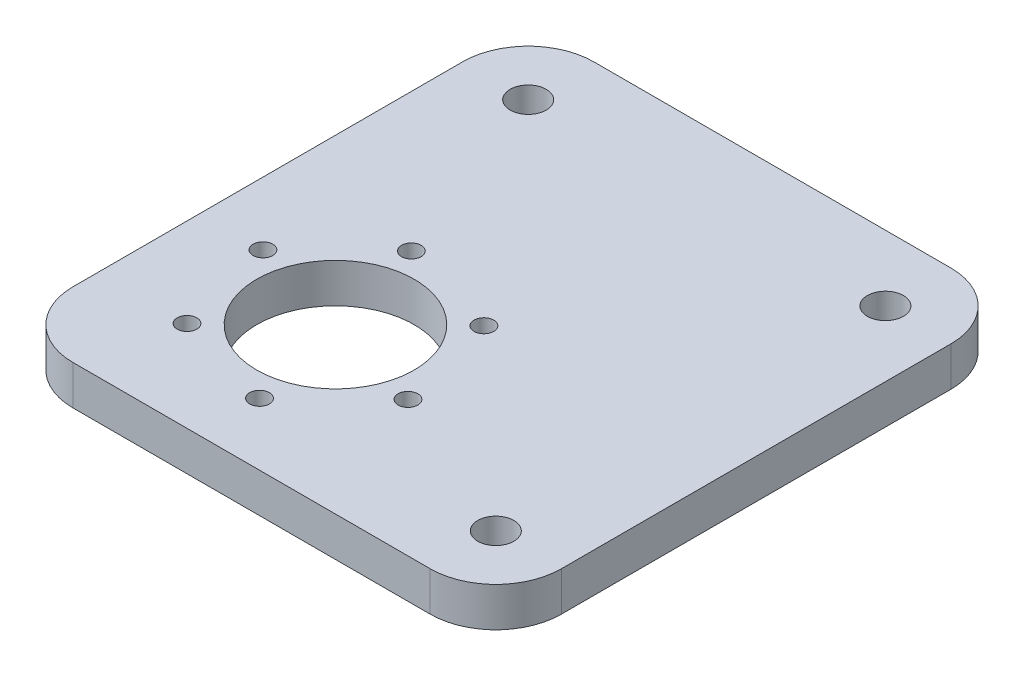
ISO-10303-21;
HEADER;
FILE_DESCRIPTION(('STEP AP214'),'2;1');
FILE_NAME('part.step','',(''),(''),'','','');
FILE_SCHEMA(('AUTOMOTIVE_DESIGN { 1 0 10303 214 1 1 1 1 }'));
ENDSEC;
DATA;
#1=APPLICATION_CONTEXT('core data for automotive mechanical design processes');
#2=APPLICATION_PROTOCOL_DEFINITION('international standard','automotive_design',2000,#1);
#3=PRODUCT_CONTEXT('',#1,'mechanical');
#4=PRODUCT('Part','Part','',(#3));
#5=PRODUCT_RELATED_PRODUCT_CATEGORY('part','',(#4));
#6=PRODUCT_DEFINITION_FORMATION('','',#4);
#7=PRODUCT_DEFINITION_CONTEXT('part definition',#1,'design');
#8=PRODUCT_DEFINITION('design','',#6,#7);
#9=PRODUCT_DEFINITION_SHAPE('','',#8);
#10=(LENGTH_UNIT() NAMED_UNIT(*) SI_UNIT(.MILLI.,.METRE.));
#11=(NAMED_UNIT(*) PLANE_ANGLE_UNIT() SI_UNIT($,.RADIAN.));
#12=(NAMED_UNIT(*) SI_UNIT($,.STERADIAN.) SOLID_ANGLE_UNIT());
#13=UNCERTAINTY_MEASURE_WITH_UNIT(LENGTH_MEASURE(1.E-05),#10,'distance_accuracy_value','');
#14=(GEOMETRIC_REPRESENTATION_CONTEXT(3) GLOBAL_UNCERTAINTY_ASSIGNED_CONTEXT((#13)) GLOBAL_UNIT_ASSIGNED_CONTEXT((#10,
#11,#12)) REPRESENTATION_CONTEXT('',''));
#15=CARTESIAN_POINT('',(0.,0.,0.));
#16=DIRECTION('',(0.,0.,1.));
#17=DIRECTION('',(1.,0.,0.));
#18=AXIS2_PLACEMENT_3D('',#15,#16,#17);
#19=CARTESIAN_POINT('',(0.,6.,0.));
#20=DIRECTION('',(0.,1.,0.));
#21=DIRECTION('',(0.,0.,1.));
#22=AXIS2_PLACEMENT_3D('',#19,#20,#21);
#23=PLANE('',#22);
#24=CARTESIAN_POINT('',(21.7056647036623,6.,5.19863708426601));
#25=DIRECTION('',(0.,-1.,0.));
#26=DIRECTION('',(0.,0.,-1.));
#27=AXIS2_PLACEMENT_3D('',#24,#25,#26);
#28=CIRCLE('',#27,1.5);
#29=CARTESIAN_POINT('',(21.7056647036623,6.,3.69863708426601));
#30=VERTEX_POINT('',#29);
#31=EDGE_CURVE('E199',#30,#30,#28,.T.);
#32=ORIENTED_EDGE('',*,*,#31,.T.);
#33=EDGE_LOOP('',(#32));
#34=FACE_BOUND('',#33,.T.);
#35=CARTESIAN_POINT('',(17.7684552129794,6.,-10.3093731500122));
#36=DIRECTION('',(0.,-1.,0.));
#37=DIRECTION('',(0.,0.,-1.));
#38=AXIS2_PLACEMENT_3D('',#35,#36,#37);
#39=CIRCLE('',#38,1.5);
#40=CARTESIAN_POINT('',(17.7684552129794,6.,-11.8093731500122));
#41=VERTEX_POINT('',#40);
#42=EDGE_CURVE('E228',#41,#41,#39,.T.);
#43=ORIENTED_EDGE('',*,*,#42,.T.);
#44=EDGE_LOOP('',(#43));
#45=FACE_BOUND('',#44,.T.);
#46=CARTESIAN_POINT('',(2.36951964260416,6.,-14.6536548281987));
#47=DIRECTION('',(0.,-1.,0.));
#48=DIRECTION('',(0.,0.,-1.));
#49=AXIS2_PLACEMENT_3D('',#46,#47,#48);
#50=CIRCLE('',#49,1.5);
#51=CARTESIAN_POINT('',(2.36951964260416,6.,-16.1536548281987));
#52=VERTEX_POINT('',#51);
#53=EDGE_CURVE('E216',#52,#52,#50,.T.);
#54=ORIENTED_EDGE('',*,*,#53,.T.);
#55=EDGE_LOOP('',(#54));
#56=FACE_BOUND('',#55,.T.);
#57=CARTESIAN_POINT('',(-9.0922064370885,6.,-3.48992627210719));
#58=DIRECTION('',(0.,-1.,0.));
#59=DIRECTION('',(0.,0.,-1.));
#60=AXIS2_PLACEMENT_3D('',#57,#58,#59);
#61=CIRCLE('',#60,1.5);
#62=CARTESIAN_POINT('',(-9.0922064370885,6.,-4.98992627210719));
#63=VERTEX_POINT('',#62);
#64=EDGE_CURVE('E213',#63,#63,#61,.T.);
#65=ORIENTED_EDGE('',*,*,#64,.T.);
#66=EDGE_LOOP('',(#65));
#67=FACE_BOUND('',#66,.T.);
#68=CARTESIAN_POINT('',(-5.15499694640573,6.,12.018083962171));
#69=DIRECTION('',(0.,-1.,0.));
#70=DIRECTION('',(0.,0.,-1.));
#71=AXIS2_PLACEMENT_3D('',#68,#69,#70);
#72=CIRCLE('',#71,1.5);
#73=CARTESIAN_POINT('',(-5.15499694640573,6.,10.518083962171));
#74=VERTEX_POINT('',#73);
#75=EDGE_CURVE('E206',#74,#74,#72,.T.);
#76=ORIENTED_EDGE('',*,*,#75,.T.);
#77=EDGE_LOOP('',(#76));
#78=FACE_BOUND('',#77,.T.);
#79=CARTESIAN_POINT('',(10.2439386239696,6.,16.3623656403577));
#80=DIRECTION('',(0.,-1.,0.));
#81=DIRECTION('',(0.,0.,-1.));
#82=AXIS2_PLACEMENT_3D('',#79,#80,#81);
#83=CIRCLE('',#82,1.5);
#84=CARTESIAN_POINT('',(10.2439386239696,6.,14.8623656403577));
#85=VERTEX_POINT('',#84);
#86=EDGE_CURVE('E205',#85,#85,#83,.T.);
#87=ORIENTED_EDGE('',*,*,#86,.T.);
#88=EDGE_LOOP('',(#87));
#89=FACE_BOUND('',#88,.T.);
#90=CARTESIAN_POINT('',(45.7467291332951,6.,15.8543554061125));
#91=DIRECTION('',(0.,1.,0.));
#92=DIRECTION('',(0.,0.,1.));
#93=AXIS2_PLACEMENT_3D('',#90,#91,#92);
#94=CIRCLE('',#93,2.75);
#95=CARTESIAN_POINT('',(45.7467291332951,6.,18.6043554061125));
#96=VERTEX_POINT('',#95);
#97=EDGE_CURVE('E185',#96,#96,#94,.T.);
#98=ORIENTED_EDGE('',*,*,#97,.F.);
#99=EDGE_LOOP('',(#98));
#100=FACE_BOUND('',#99,.T.);
#101=CARTESIAN_POINT('',(45.7467291332951,6.,-43.5256445938875));
#102=DIRECTION('',(0.,1.,0.));
#103=DIRECTION('',(0.,0.,1.));
#104=AXIS2_PLACEMENT_3D('',#101,#102,#103);
#105=CIRCLE('',#104,2.75);
#106=CARTESIAN_POINT('',(45.7467291332951,6.,-40.7756445938875));
#107=VERTEX_POINT('',#106);
#108=EDGE_CURVE('E187',#107,#107,#105,.T.);
#109=ORIENTED_EDGE('',*,*,#108,.F.);
#110=EDGE_LOOP('',(#109));
#111=FACE_BOUND('',#110,.T.);
#112=CARTESIAN_POINT('',(-8.69327086670492,6.,-43.5256445938875));
#113=DIRECTION('',(0.,1.,0.));
#114=DIRECTION('',(0.,0.,1.));
#115=AXIS2_PLACEMENT_3D('',#112,#113,#114);
#116=CIRCLE('',#115,2.75);
#117=CARTESIAN_POINT('',(-8.69327086670492,6.,-40.7756445938875));
#118=VERTEX_POINT('',#117);
#119=EDGE_CURVE('E186',#118,#118,#116,.T.);
#120=ORIENTED_EDGE('',*,*,#119,.F.);
#121=EDGE_LOOP('',(#120));
#122=FACE_BOUND('',#121,.T.);
#123=DIRECTION('',(0.,0.,-1.));
#124=VECTOR('',#123,1.);
#125=CARTESIAN_POINT('',(55.7467291332951,6.,-53.5256445938875));
#126=LINE('',#125,#124);
#127=CARTESIAN_POINT('',(55.7467291332951,6.,15.8543554061125));
#128=VERTEX_POINT('',#127);
#129=CARTESIAN_POINT('',(55.7467291332951,6.,-43.5256445938875));
#130=VERTEX_POINT('',#129);
#131=EDGE_CURVE('E180',#128,#130,#126,.T.);
#132=ORIENTED_EDGE('',*,*,#131,.T.);
#133=CARTESIAN_POINT('',(45.7467291332951,6.,-43.5256445938875));
#134=DIRECTION('',(0.,1.,0.));
#135=DIRECTION('',(0.,0.,1.));
#136=AXIS2_PLACEMENT_3D('',#133,#134,#135);
#137=CIRCLE('',#136,10.);
#138=CARTESIAN_POINT('',(45.7467291332951,6.,-53.5256445938875));
#139=VERTEX_POINT('',#138);
#140=EDGE_CURVE('E155',#130,#139,#137,.T.);
#141=ORIENTED_EDGE('',*,*,#140,.T.);
#142=DIRECTION('',(-1.,0.,0.));
#143=VECTOR('',#142,1.);
#144=CARTESIAN_POINT('',(-18.6932708667049,6.,-53.5256445938875));
#145=LINE('',#144,#143);
#146=CARTESIAN_POINT('',(-8.69327086670492,6.,-53.5256445938875));
#147=VERTEX_POINT('',#146);
#148=EDGE_CURVE('E123',#139,#147,#145,.T.);
#149=ORIENTED_EDGE('',*,*,#148,.T.);
#150=CARTESIAN_POINT('',(-8.69327086670492,6.,-43.5256445938875));
#151=DIRECTION('',(0.,1.,0.));
#152=DIRECTION('',(0.,0.,1.));
#153=AXIS2_PLACEMENT_3D('',#150,#151,#152);
#154=CIRCLE('',#153,10.);
#155=CARTESIAN_POINT('',(-18.6932708667049,6.,-43.5256445938875));
#156=VERTEX_POINT('',#155);
#157=EDGE_CURVE('E154',#147,#156,#154,.T.);
#158=ORIENTED_EDGE('',*,*,#157,.T.);
#159=DIRECTION('',(0.,0.,1.));
#160=VECTOR('',#159,1.);
#161=CARTESIAN_POINT('',(-18.6932708667049,6.,-53.5256445938875));
#162=LINE('',#161,#160);
#163=CARTESIAN_POINT('',(-18.6932708667049,6.,15.8543554061125));
#164=VERTEX_POINT('',#163);
#165=EDGE_CURVE('E134',#156,#164,#162,.T.);
#166=ORIENTED_EDGE('',*,*,#165,.T.);
#167=CARTESIAN_POINT('',(-8.69327086670492,6.,15.8543554061125));
#168=DIRECTION('',(0.,1.,0.));
#169=DIRECTION('',(0.,0.,1.));
#170=AXIS2_PLACEMENT_3D('',#167,#168,#169);
#171=CIRCLE('',#170,10.);
#172=CARTESIAN_POINT('',(-8.69327086670492,6.,25.8543554061125));
#173=VERTEX_POINT('',#172);
#174=EDGE_CURVE('E58',#164,#173,#171,.T.);
#175=ORIENTED_EDGE('',*,*,#174,.T.);
#176=DIRECTION('',(1.,0.,0.));
#177=VECTOR('',#176,1.);
#178=CARTESIAN_POINT('',(-18.6932708667049,6.,25.8543554061125));
#179=LINE('',#178,#177);
#180=CARTESIAN_POINT('',(45.7467291332951,6.,25.8543554061125));
#181=VERTEX_POINT('',#180);
#182=EDGE_CURVE('E131',#173,#181,#179,.T.);
#183=ORIENTED_EDGE('',*,*,#182,.T.);
#184=CARTESIAN_POINT('',(45.7467291332951,6.,15.8543554061125));
#185=DIRECTION('',(0.,1.,0.));
#186=DIRECTION('',(0.,0.,1.));
#187=AXIS2_PLACEMENT_3D('',#184,#185,#186);
#188=CIRCLE('',#187,10.);
#189=EDGE_CURVE('E148',#181,#128,#188,.T.);
#190=ORIENTED_EDGE('',*,*,#189,.T.);
#191=EDGE_LOOP('',(#132,#141,#149,#158,#166,#175,#183,#190));
#192=FACE_BOUND('',#191,.T.);
#193=CARTESIAN_POINT('',(6.30672913329509,6.,0.854355406112513));
#194=DIRECTION('',(0.,1.,0.));
#195=DIRECTION('',(0.,0.,1.));
#196=AXIS2_PLACEMENT_3D('',#193,#194,#195);
#197=CIRCLE('',#196,12.);
#198=CARTESIAN_POINT('',(6.30672913329509,6.,12.8543554061125));
#199=VERTEX_POINT('',#198);
#200=EDGE_CURVE('E167',#199,#199,#197,.T.);
#201=ORIENTED_EDGE('',*,*,#200,.F.);
#202=EDGE_LOOP('',(#201));
#203=FACE_BOUND('',#202,.T.);
#204=ADVANCED_FACE('F39',(#34,#45,#56,#67,#78,#89,#100,#111,#122,#192,#203),#23,.T.);
#205=CARTESIAN_POINT('',(0.,0.,0.));
#206=DIRECTION('',(0.,1.,0.));
#207=DIRECTION('',(0.,0.,1.));
#208=AXIS2_PLACEMENT_3D('',#205,#206,#207);
#209=PLANE('',#208);
#210=CARTESIAN_POINT('',(21.7056647036623,0.,5.19863708426601));
#211=DIRECTION('',(0.,-1.,0.));
#212=DIRECTION('',(0.,0.,-1.));
#213=AXIS2_PLACEMENT_3D('',#210,#211,#212);
#214=CIRCLE('',#213,1.5);
#215=CARTESIAN_POINT('',(21.7056647036623,0.,3.69863708426601));
#216=VERTEX_POINT('',#215);
#217=EDGE_CURVE('E235',#216,#216,#214,.T.);
#218=ORIENTED_EDGE('',*,*,#217,.F.);
#219=EDGE_LOOP('',(#218));
#220=FACE_BOUND('',#219,.T.);
#221=CARTESIAN_POINT('',(17.7684552129794,0.,-10.3093731500122));
#222=DIRECTION('',(0.,-1.,0.));
#223=DIRECTION('',(0.,0.,-1.));
#224=AXIS2_PLACEMENT_3D('',#221,#222,#223);
#225=CIRCLE('',#224,1.5);
#226=CARTESIAN_POINT('',(17.7684552129794,0.,-11.8093731500122));
#227=VERTEX_POINT('',#226);
#228=EDGE_CURVE('E230',#227,#227,#225,.T.);
#229=ORIENTED_EDGE('',*,*,#228,.F.);
#230=EDGE_LOOP('',(#229));
#231=FACE_BOUND('',#230,.T.);
#232=CARTESIAN_POINT('',(2.36951964260416,0.,-14.6536548281987));
#233=DIRECTION('',(0.,-1.,0.));
#234=DIRECTION('',(0.,0.,-1.));
#235=AXIS2_PLACEMENT_3D('',#232,#233,#234);
#236=CIRCLE('',#235,1.5);
#237=CARTESIAN_POINT('',(2.36951964260416,0.,-16.1536548281987));
#238=VERTEX_POINT('',#237);
#239=EDGE_CURVE('E221',#238,#238,#236,.T.);
#240=ORIENTED_EDGE('',*,*,#239,.F.);
#241=EDGE_LOOP('',(#240));
#242=FACE_BOUND('',#241,.T.);
#243=CARTESIAN_POINT('',(-9.0922064370885,0.,-3.48992627210719));
#244=DIRECTION('',(0.,-1.,0.));
#245=DIRECTION('',(0.,0.,-1.));
#246=AXIS2_PLACEMENT_3D('',#243,#244,#245);
#247=CIRCLE('',#246,1.5);
#248=CARTESIAN_POINT('',(-9.0922064370885,0.,-4.98992627210719));
#249=VERTEX_POINT('',#248);
#250=EDGE_CURVE('E219',#249,#249,#247,.T.);
#251=ORIENTED_EDGE('',*,*,#250,.F.);
#252=EDGE_LOOP('',(#251));
#253=FACE_BOUND('',#252,.T.);
#254=CARTESIAN_POINT('',(-5.15499694640573,0.,12.018083962171));
#255=DIRECTION('',(0.,-1.,0.));
#256=DIRECTION('',(0.,0.,-1.));
#257=AXIS2_PLACEMENT_3D('',#254,#255,#256);
#258=CIRCLE('',#257,1.5);
#259=CARTESIAN_POINT('',(-5.15499694640573,0.,10.518083962171));
#260=VERTEX_POINT('',#259);
#261=EDGE_CURVE('E211',#260,#260,#258,.T.);
#262=ORIENTED_EDGE('',*,*,#261,.F.);
#263=EDGE_LOOP('',(#262));
#264=FACE_BOUND('',#263,.T.);
#265=CARTESIAN_POINT('',(10.2439386239696,0.,16.3623656403577));
#266=DIRECTION('',(0.,-1.,0.));
#267=DIRECTION('',(0.,0.,-1.));
#268=AXIS2_PLACEMENT_3D('',#265,#266,#267);
#269=CIRCLE('',#268,1.5);
#270=CARTESIAN_POINT('',(10.2439386239696,0.,14.8623656403577));
#271=VERTEX_POINT('',#270);
#272=EDGE_CURVE('E204',#271,#271,#269,.T.);
#273=ORIENTED_EDGE('',*,*,#272,.F.);
#274=EDGE_LOOP('',(#273));
#275=FACE_BOUND('',#274,.T.);
#276=CARTESIAN_POINT('',(45.7467291332951,0.,15.8543554061125));
#277=DIRECTION('',(0.,-1.,0.));
#278=DIRECTION('',(0.,0.,-1.));
#279=AXIS2_PLACEMENT_3D('',#276,#277,#278);
#280=CIRCLE('',#279,2.75);
#281=CARTESIAN_POINT('',(45.7467291332951,0.,13.1043554061125));
#282=VERTEX_POINT('',#281);
#283=EDGE_CURVE('E195',#282,#282,#280,.T.);
#284=ORIENTED_EDGE('',*,*,#283,.F.);
#285=EDGE_LOOP('',(#284));
#286=FACE_BOUND('',#285,.T.);
#287=CARTESIAN_POINT('',(45.7467291332951,0.,-43.5256445938875));
#288=DIRECTION('',(0.,-1.,0.));
#289=DIRECTION('',(0.,0.,-1.));
#290=AXIS2_PLACEMENT_3D('',#287,#288,#289);
#291=CIRCLE('',#290,2.75);
#292=CARTESIAN_POINT('',(45.7467291332951,0.,-46.2756445938875));
#293=VERTEX_POINT('',#292);
#294=EDGE_CURVE('E198',#293,#293,#291,.T.);
#295=ORIENTED_EDGE('',*,*,#294,.F.);
#296=EDGE_LOOP('',(#295));
#297=FACE_BOUND('',#296,.T.);
#298=CARTESIAN_POINT('',(-8.69327086670492,0.,-43.5256445938875));
#299=DIRECTION('',(0.,-1.,0.));
#300=DIRECTION('',(0.,0.,-1.));
#301=AXIS2_PLACEMENT_3D('',#298,#299,#300);
#302=CIRCLE('',#301,2.75);
#303=CARTESIAN_POINT('',(-8.69327086670492,0.,-46.2756445938875));
#304=VERTEX_POINT('',#303);
#305=EDGE_CURVE('E192',#304,#304,#302,.T.);
#306=ORIENTED_EDGE('',*,*,#305,.F.);
#307=EDGE_LOOP('',(#306));
#308=FACE_BOUND('',#307,.T.);
#309=DIRECTION('',(-1.,0.,0.));
#310=VECTOR('',#309,1.);
#311=CARTESIAN_POINT('',(-18.6932708667049,0.,-53.5256445938875));
#312=LINE('',#311,#310);
#313=CARTESIAN_POINT('',(45.7467291332951,0.,-53.5256445938875));
#314=VERTEX_POINT('',#313);
#315=CARTESIAN_POINT('',(-8.69327086670492,0.,-53.5256445938875));
#316=VERTEX_POINT('',#315);
#317=EDGE_CURVE('E125',#314,#316,#312,.T.);
#318=ORIENTED_EDGE('',*,*,#317,.F.);
#319=CARTESIAN_POINT('',(45.7467291332951,0.,-43.5256445938875));
#320=DIRECTION('',(0.,1.,0.));
#321=DIRECTION('',(0.,0.,1.));
#322=AXIS2_PLACEMENT_3D('',#319,#320,#321);
#323=CIRCLE('',#322,10.);
#324=CARTESIAN_POINT('',(55.7467291332951,0.,-43.5256445938875));
#325=VERTEX_POINT('',#324);
#326=EDGE_CURVE('E102',#314,#325,#323,.F.);
#327=ORIENTED_EDGE('',*,*,#326,.T.);
#328=DIRECTION('',(0.,0.,-1.));
#329=VECTOR('',#328,1.);
#330=CARTESIAN_POINT('',(55.7467291332951,0.,-53.5256445938875));
#331=LINE('',#330,#329);
#332=CARTESIAN_POINT('',(55.7467291332951,0.,15.8543554061125));
#333=VERTEX_POINT('',#332);
#334=EDGE_CURVE('E132',#333,#325,#331,.T.);
#335=ORIENTED_EDGE('',*,*,#334,.F.);
#336=CARTESIAN_POINT('',(45.7467291332951,0.,15.8543554061125));
#337=DIRECTION('',(0.,1.,0.));
#338=DIRECTION('',(0.,0.,1.));
#339=AXIS2_PLACEMENT_3D('',#336,#337,#338);
#340=CIRCLE('',#339,10.);
#341=CARTESIAN_POINT('',(45.7467291332951,0.,25.8543554061125));
#342=VERTEX_POINT('',#341);
#343=EDGE_CURVE('E126',#333,#342,#340,.F.);
#344=ORIENTED_EDGE('',*,*,#343,.T.);
#345=DIRECTION('',(1.,0.,0.));
#346=VECTOR('',#345,1.);
#347=CARTESIAN_POINT('',(-18.6932708667049,0.,25.8543554061125));
#348=LINE('',#347,#346);
#349=CARTESIAN_POINT('',(-8.69327086670492,0.,25.8543554061125));
#350=VERTEX_POINT('',#349);
#351=EDGE_CURVE('E140',#350,#342,#348,.T.);
#352=ORIENTED_EDGE('',*,*,#351,.F.);
#353=CARTESIAN_POINT('',(-8.69327086670492,0.,15.8543554061125));
#354=DIRECTION('',(0.,1.,0.));
#355=DIRECTION('',(0.,0.,1.));
#356=AXIS2_PLACEMENT_3D('',#353,#354,#355);
#357=CIRCLE('',#356,10.);
#358=CARTESIAN_POINT('',(-18.6932708667049,0.,15.8543554061125));
#359=VERTEX_POINT('',#358);
#360=EDGE_CURVE('E141',#350,#359,#357,.F.);
#361=ORIENTED_EDGE('',*,*,#360,.T.);
#362=DIRECTION('',(0.,0.,1.));
#363=VECTOR('',#362,1.);
#364=CARTESIAN_POINT('',(-18.6932708667049,0.,-53.5256445938875));
#365=LINE('',#364,#363);
#366=CARTESIAN_POINT('',(-18.6932708667049,0.,-43.5256445938875));
#367=VERTEX_POINT('',#366);
#368=EDGE_CURVE('E164',#367,#359,#365,.T.);
#369=ORIENTED_EDGE('',*,*,#368,.F.);
#370=CARTESIAN_POINT('',(-8.69327086670492,0.,-43.5256445938875));
#371=DIRECTION('',(0.,1.,0.));
#372=DIRECTION('',(0.,0.,1.));
#373=AXIS2_PLACEMENT_3D('',#370,#371,#372);
#374=CIRCLE('',#373,10.);
#375=EDGE_CURVE('E116',#367,#316,#374,.F.);
#376=ORIENTED_EDGE('',*,*,#375,.T.);
#377=EDGE_LOOP('',(#318,#327,#335,#344,#352,#361,#369,#376));
#378=FACE_BOUND('',#377,.T.);
#379=CARTESIAN_POINT('',(6.30672913329509,0.,0.854355406112513));
#380=DIRECTION('',(0.,1.,0.));
#381=DIRECTION('',(0.,0.,1.));
#382=AXIS2_PLACEMENT_3D('',#379,#380,#381);
#383=CIRCLE('',#382,12.);
#384=CARTESIAN_POINT('',(6.30672913329509,0.,12.8543554061125));
#385=VERTEX_POINT('',#384);
#386=EDGE_CURVE('E173',#385,#385,#383,.T.);
#387=ORIENTED_EDGE('',*,*,#386,.T.);
#388=EDGE_LOOP('',(#387));
#389=FACE_BOUND('',#388,.T.);
#390=ADVANCED_FACE('F128',(#220,#231,#242,#253,#264,#275,#286,#297,#308,#378,#389),#209,.F.);
#391=CARTESIAN_POINT('',(-18.6932708667049,6.,-53.5256445938875));
#392=DIRECTION('',(1.,0.,0.));
#393=DIRECTION('',(0.,0.,-1.));
#394=AXIS2_PLACEMENT_3D('',#391,#392,#393);
#395=PLANE('',#394);
#396=ORIENTED_EDGE('',*,*,#165,.F.);
#397=DIRECTION('',(0.,-1.,0.));
#398=VECTOR('',#397,1.);
#399=CARTESIAN_POINT('',(-18.6932708667049,6.,-43.5256445938875));
#400=LINE('',#399,#398);
#401=EDGE_CURVE('E156',#156,#367,#400,.T.);
#402=ORIENTED_EDGE('',*,*,#401,.T.);
#403=ORIENTED_EDGE('',*,*,#368,.T.);
#404=DIRECTION('',(0.,-1.,0.));
#405=VECTOR('',#404,1.);
#406=CARTESIAN_POINT('',(-18.6932708667049,6.,15.8543554061125));
#407=LINE('',#406,#405);
#408=EDGE_CURVE('E158',#359,#164,#407,.F.);
#409=ORIENTED_EDGE('',*,*,#408,.T.);
#410=EDGE_LOOP('',(#396,#402,#403,#409));
#411=FACE_BOUND('',#410,.T.);
#412=ADVANCED_FACE('F165',(#411),#395,.F.);
#413=CARTESIAN_POINT('',(-18.6932708667049,6.,25.8543554061125));
#414=DIRECTION('',(0.,0.,-1.));
#415=DIRECTION('',(-1.,0.,0.));
#416=AXIS2_PLACEMENT_3D('',#413,#414,#415);
#417=PLANE('',#416);
#418=ORIENTED_EDGE('',*,*,#182,.F.);
#419=DIRECTION('',(0.,-1.,0.));
#420=VECTOR('',#419,1.);
#421=CARTESIAN_POINT('',(-8.69327086670492,6.,25.8543554061125));
#422=LINE('',#421,#420);
#423=EDGE_CURVE('E11',#173,#350,#422,.T.);
#424=ORIENTED_EDGE('',*,*,#423,.T.);
#425=ORIENTED_EDGE('',*,*,#351,.T.);
#426=DIRECTION('',(0.,-1.,0.));
#427=VECTOR('',#426,1.);
#428=CARTESIAN_POINT('',(45.7467291332951,6.,25.8543554061125));
#429=LINE('',#428,#427);
#430=EDGE_CURVE('E50',#342,#181,#429,.F.);
#431=ORIENTED_EDGE('',*,*,#430,.T.);
#432=EDGE_LOOP('',(#418,#424,#425,#431));
#433=FACE_BOUND('',#432,.T.);
#434=ADVANCED_FACE('F293',(#433),#417,.F.);
#435=CARTESIAN_POINT('',(55.7467291332951,6.,-53.5256445938875));
#436=DIRECTION('',(-1.,0.,0.));
#437=DIRECTION('',(0.,0.,1.));
#438=AXIS2_PLACEMENT_3D('',#435,#436,#437);
#439=PLANE('',#438);
#440=ORIENTED_EDGE('',*,*,#334,.T.);
#441=DIRECTION('',(0.,-1.,0.));
#442=VECTOR('',#441,1.);
#443=CARTESIAN_POINT('',(55.7467291332951,6.,-43.5256445938875));
#444=LINE('',#443,#442);
#445=EDGE_CURVE('E109',#325,#130,#444,.F.);
#446=ORIENTED_EDGE('',*,*,#445,.T.);
#447=ORIENTED_EDGE('',*,*,#131,.F.);
#448=DIRECTION('',(0.,-1.,0.));
#449=VECTOR('',#448,1.);
#450=CARTESIAN_POINT('',(55.7467291332951,6.,15.8543554061125));
#451=LINE('',#450,#449);
#452=EDGE_CURVE('E114',#128,#333,#451,.T.);
#453=ORIENTED_EDGE('',*,*,#452,.T.);
#454=EDGE_LOOP('',(#440,#446,#447,#453));
#455=FACE_BOUND('',#454,.T.);
#456=ADVANCED_FACE('F286',(#455),#439,.F.);
#457=CARTESIAN_POINT('',(-18.6932708667049,6.,-53.5256445938875));
#458=DIRECTION('',(0.,0.,1.));
#459=DIRECTION('',(1.,0.,0.));
#460=AXIS2_PLACEMENT_3D('',#457,#458,#459);
#461=PLANE('',#460);
#462=ORIENTED_EDGE('',*,*,#148,.F.);
#463=DIRECTION('',(0.,-1.,0.));
#464=VECTOR('',#463,1.);
#465=CARTESIAN_POINT('',(45.7467291332951,6.,-53.5256445938875));
#466=LINE('',#465,#464);
#467=EDGE_CURVE('E107',#139,#314,#466,.T.);
#468=ORIENTED_EDGE('',*,*,#467,.T.);
#469=ORIENTED_EDGE('',*,*,#317,.T.);
#470=DIRECTION('',(0.,-1.,0.));
#471=VECTOR('',#470,1.);
#472=CARTESIAN_POINT('',(-8.69327086670492,6.,-53.5256445938875));
#473=LINE('',#472,#471);
#474=EDGE_CURVE('E130',#316,#147,#473,.F.);
#475=ORIENTED_EDGE('',*,*,#474,.T.);
#476=EDGE_LOOP('',(#462,#468,#469,#475));
#477=FACE_BOUND('',#476,.T.);
#478=ADVANCED_FACE('F122',(#477),#461,.F.);
#479=CARTESIAN_POINT('',(6.30672913329509,6.,0.854355406112513));
#480=DIRECTION('',(0.,-1.,0.));
#481=DIRECTION('',(0.,0.,-1.));
#482=AXIS2_PLACEMENT_3D('',#479,#480,#481);
#483=CYLINDRICAL_SURFACE('',#482,12.);
#484=ORIENTED_EDGE('',*,*,#200,.T.);
#485=EDGE_LOOP('',(#484));
#486=FACE_BOUND('',#485,.T.);
#487=ORIENTED_EDGE('',*,*,#386,.F.);
#488=EDGE_LOOP('',(#487));
#489=FACE_BOUND('',#488,.T.);
#490=ADVANCED_FACE('F267',(#486,#489),#483,.F.);
#491=CARTESIAN_POINT('',(-8.69327086670492,10.,-43.5256445938875));
#492=DIRECTION('',(0.,-1.,0.));
#493=DIRECTION('',(0.,0.,-1.));
#494=AXIS2_PLACEMENT_3D('',#491,#492,#493);
#495=CYLINDRICAL_SURFACE('',#494,2.75);
#496=ORIENTED_EDGE('',*,*,#119,.T.);
#497=EDGE_LOOP('',(#496));
#498=FACE_BOUND('',#497,.T.);
#499=ORIENTED_EDGE('',*,*,#305,.T.);
#500=EDGE_LOOP('',(#499));
#501=FACE_BOUND('',#500,.T.);
#502=ADVANCED_FACE('F268',(#498,#501),#495,.F.);
#503=CARTESIAN_POINT('',(45.7467291332951,10.,-43.5256445938875));
#504=DIRECTION('',(0.,-1.,0.));
#505=DIRECTION('',(0.,0.,-1.));
#506=AXIS2_PLACEMENT_3D('',#503,#504,#505);
#507=CYLINDRICAL_SURFACE('',#506,2.75);
#508=ORIENTED_EDGE('',*,*,#108,.T.);
#509=EDGE_LOOP('',(#508));
#510=FACE_BOUND('',#509,.T.);
#511=ORIENTED_EDGE('',*,*,#294,.T.);
#512=EDGE_LOOP('',(#511));
#513=FACE_BOUND('',#512,.T.);
#514=ADVANCED_FACE('F266',(#510,#513),#507,.F.);
#515=CARTESIAN_POINT('',(45.7467291332951,10.,15.8543554061125));
#516=DIRECTION('',(0.,-1.,0.));
#517=DIRECTION('',(0.,0.,-1.));
#518=AXIS2_PLACEMENT_3D('',#515,#516,#517);
#519=CYLINDRICAL_SURFACE('',#518,2.75);
#520=ORIENTED_EDGE('',*,*,#97,.T.);
#521=EDGE_LOOP('',(#520));
#522=FACE_BOUND('',#521,.T.);
#523=ORIENTED_EDGE('',*,*,#283,.T.);
#524=EDGE_LOOP('',(#523));
#525=FACE_BOUND('',#524,.T.);
#526=ADVANCED_FACE('F276',(#522,#525),#519,.F.);
#527=CARTESIAN_POINT('',(10.2439386239696,6.,16.3623656403577));
#528=DIRECTION('',(0.,-1.,0.));
#529=DIRECTION('',(0.,0.,-1.));
#530=AXIS2_PLACEMENT_3D('',#527,#528,#529);
#531=CYLINDRICAL_SURFACE('',#530,1.5);
#532=ORIENTED_EDGE('',*,*,#86,.F.);
#533=EDGE_LOOP('',(#532));
#534=FACE_BOUND('',#533,.T.);
#535=ORIENTED_EDGE('',*,*,#272,.T.);
#536=EDGE_LOOP('',(#535));
#537=FACE_BOUND('',#536,.T.);
#538=ADVANCED_FACE('F379',(#534,#537),#531,.F.);
#539=CARTESIAN_POINT('',(-5.15499694640573,6.,12.018083962171));
#540=DIRECTION('',(0.,-1.,0.));
#541=DIRECTION('',(0.,0.,-1.));
#542=AXIS2_PLACEMENT_3D('',#539,#540,#541);
#543=CYLINDRICAL_SURFACE('',#542,1.5);
#544=ORIENTED_EDGE('',*,*,#75,.F.);
#545=EDGE_LOOP('',(#544));
#546=FACE_BOUND('',#545,.T.);
#547=ORIENTED_EDGE('',*,*,#261,.T.);
#548=EDGE_LOOP('',(#547));
#549=FACE_BOUND('',#548,.T.);
#550=ADVANCED_FACE('F369',(#546,#549),#543,.F.);
#551=CARTESIAN_POINT('',(-9.0922064370885,6.,-3.48992627210719));
#552=DIRECTION('',(0.,-1.,0.));
#553=DIRECTION('',(0.,0.,-1.));
#554=AXIS2_PLACEMENT_3D('',#551,#552,#553);
#555=CYLINDRICAL_SURFACE('',#554,1.5);
#556=ORIENTED_EDGE('',*,*,#64,.F.);
#557=EDGE_LOOP('',(#556));
#558=FACE_BOUND('',#557,.T.);
#559=ORIENTED_EDGE('',*,*,#250,.T.);
#560=EDGE_LOOP('',(#559));
#561=FACE_BOUND('',#560,.T.);
#562=ADVANCED_FACE('F359',(#558,#561),#555,.F.);
#563=CARTESIAN_POINT('',(2.36951964260416,6.,-14.6536548281987));
#564=DIRECTION('',(0.,-1.,0.));
#565=DIRECTION('',(0.,0.,-1.));
#566=AXIS2_PLACEMENT_3D('',#563,#564,#565);
#567=CYLINDRICAL_SURFACE('',#566,1.5);
#568=ORIENTED_EDGE('',*,*,#53,.F.);
#569=EDGE_LOOP('',(#568));
#570=FACE_BOUND('',#569,.T.);
#571=ORIENTED_EDGE('',*,*,#239,.T.);
#572=EDGE_LOOP('',(#571));
#573=FACE_BOUND('',#572,.T.);
#574=ADVANCED_FACE('F346',(#570,#573),#567,.F.);
#575=CARTESIAN_POINT('',(17.7684552129794,6.,-10.3093731500122));
#576=DIRECTION('',(0.,-1.,0.));
#577=DIRECTION('',(0.,0.,-1.));
#578=AXIS2_PLACEMENT_3D('',#575,#576,#577);
#579=CYLINDRICAL_SURFACE('',#578,1.5);
#580=ORIENTED_EDGE('',*,*,#42,.F.);
#581=EDGE_LOOP('',(#580));
#582=FACE_BOUND('',#581,.T.);
#583=ORIENTED_EDGE('',*,*,#228,.T.);
#584=EDGE_LOOP('',(#583));
#585=FACE_BOUND('',#584,.T.);
#586=ADVANCED_FACE('F243',(#582,#585),#579,.F.);
#587=CARTESIAN_POINT('',(21.7056647036623,6.,5.19863708426601));
#588=DIRECTION('',(0.,-1.,0.));
#589=DIRECTION('',(0.,0.,-1.));
#590=AXIS2_PLACEMENT_3D('',#587,#588,#589);
#591=CYLINDRICAL_SURFACE('',#590,1.5);
#592=ORIENTED_EDGE('',*,*,#31,.F.);
#593=EDGE_LOOP('',(#592));
#594=FACE_BOUND('',#593,.T.);
#595=ORIENTED_EDGE('',*,*,#217,.T.);
#596=EDGE_LOOP('',(#595));
#597=FACE_BOUND('',#596,.T.);
#598=ADVANCED_FACE('F239',(#594,#597),#591,.F.);
#599=CARTESIAN_POINT('',(45.7467291332951,6.,-43.5256445938875));
#600=DIRECTION('',(0.,-1.,0.));
#601=DIRECTION('',(0.,0.,-1.));
#602=AXIS2_PLACEMENT_3D('',#599,#600,#601);
#603=CYLINDRICAL_SURFACE('',#602,10.);
#604=ORIENTED_EDGE('',*,*,#140,.F.);
#605=ORIENTED_EDGE('',*,*,#445,.F.);
#606=ORIENTED_EDGE('',*,*,#326,.F.);
#607=ORIENTED_EDGE('',*,*,#467,.F.);
#608=EDGE_LOOP('',(#604,#605,#606,#607));
#609=FACE_BOUND('',#608,.T.);
#610=ADVANCED_FACE('F108',(#609),#603,.T.);
#611=CARTESIAN_POINT('',(-8.69327086670492,6.,-43.5256445938875));
#612=DIRECTION('',(0.,-1.,0.));
#613=DIRECTION('',(0.,0.,-1.));
#614=AXIS2_PLACEMENT_3D('',#611,#612,#613);
#615=CYLINDRICAL_SURFACE('',#614,10.);
#616=ORIENTED_EDGE('',*,*,#157,.F.);
#617=ORIENTED_EDGE('',*,*,#474,.F.);
#618=ORIENTED_EDGE('',*,*,#375,.F.);
#619=ORIENTED_EDGE('',*,*,#401,.F.);
#620=EDGE_LOOP('',(#616,#617,#618,#619));
#621=FACE_BOUND('',#620,.T.);
#622=ADVANCED_FACE('F299',(#621),#615,.T.);
#623=CARTESIAN_POINT('',(-8.69327086670492,6.,15.8543554061125));
#624=DIRECTION('',(0.,-1.,0.));
#625=DIRECTION('',(0.,0.,-1.));
#626=AXIS2_PLACEMENT_3D('',#623,#624,#625);
#627=CYLINDRICAL_SURFACE('',#626,10.);
#628=ORIENTED_EDGE('',*,*,#174,.F.);
#629=ORIENTED_EDGE('',*,*,#408,.F.);
#630=ORIENTED_EDGE('',*,*,#360,.F.);
#631=ORIENTED_EDGE('',*,*,#423,.F.);
#632=EDGE_LOOP('',(#628,#629,#630,#631));
#633=FACE_BOUND('',#632,.T.);
#634=ADVANCED_FACE('F301',(#633),#627,.T.);
#635=CARTESIAN_POINT('',(45.7467291332951,6.,15.8543554061125));
#636=DIRECTION('',(0.,-1.,0.));
#637=DIRECTION('',(0.,0.,-1.));
#638=AXIS2_PLACEMENT_3D('',#635,#636,#637);
#639=CYLINDRICAL_SURFACE('',#638,10.);
#640=ORIENTED_EDGE('',*,*,#189,.F.);
#641=ORIENTED_EDGE('',*,*,#430,.F.);
#642=ORIENTED_EDGE('',*,*,#343,.F.);
#643=ORIENTED_EDGE('',*,*,#452,.F.);
#644=EDGE_LOOP('',(#640,#641,#642,#643));
#645=FACE_BOUND('',#644,.T.);
#646=ADVANCED_FACE('F41',(#645),#639,.T.);
#647=CLOSED_SHELL('',(#204,#390,#412,#434,#456,#478,#490,#502,#514,#526,#538,#550,#562,#574,
#586,#598,#610,#622,#634,#646));
#648=MANIFOLD_SOLID_BREP('B2',#647);
#649=ADVANCED_BREP_SHAPE_REPRESENTATION('',(#18,#648),#14);
#650=SHAPE_DEFINITION_REPRESENTATION(#9,#649);
ENDSEC;
END-ISO-10303-21;
